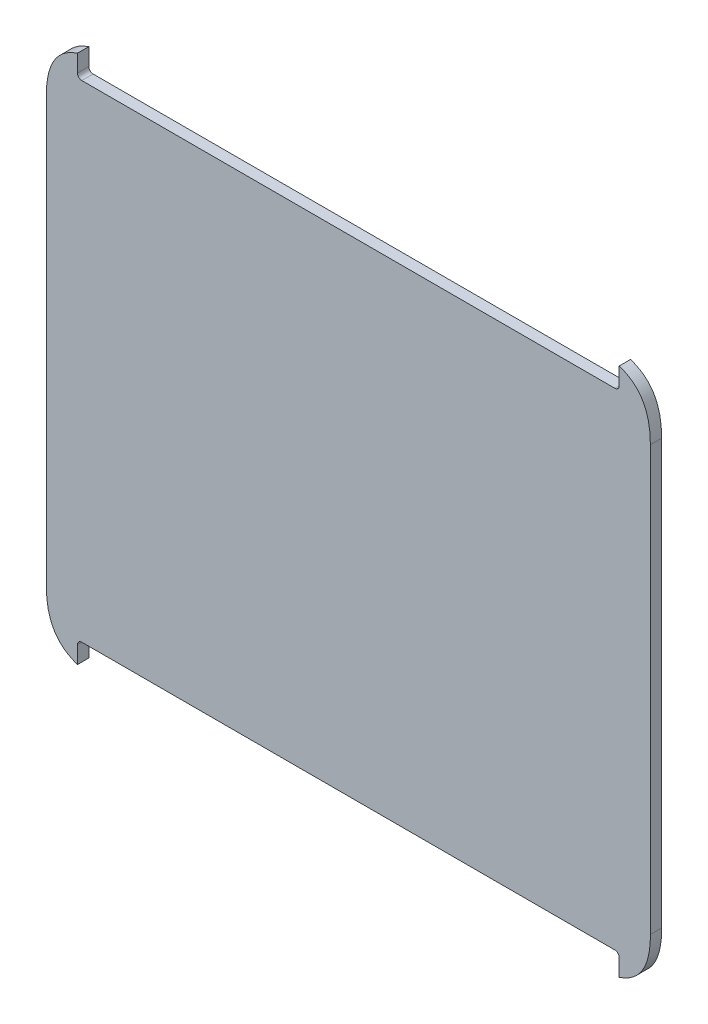
ISO-10303-21;
HEADER;
FILE_DESCRIPTION(('STEP AP214'),'2;1');
FILE_NAME('part.step','',(''),(''),'','','');
FILE_SCHEMA(('AUTOMOTIVE_DESIGN { 1 0 10303 214 1 1 1 1 }'));
ENDSEC;
DATA;
#1=APPLICATION_CONTEXT('core data for automotive mechanical design processes');
#2=APPLICATION_PROTOCOL_DEFINITION('international standard','automotive_design',2000,#1);
#3=PRODUCT_CONTEXT('',#1,'mechanical');
#4=PRODUCT('Part','Part','',(#3));
#5=PRODUCT_RELATED_PRODUCT_CATEGORY('part','',(#4));
#6=PRODUCT_DEFINITION_FORMATION('','',#4);
#7=PRODUCT_DEFINITION_CONTEXT('part definition',#1,'design');
#8=PRODUCT_DEFINITION('design','',#6,#7);
#9=PRODUCT_DEFINITION_SHAPE('','',#8);
#10=(LENGTH_UNIT() NAMED_UNIT(*) SI_UNIT(.MILLI.,.METRE.));
#11=(NAMED_UNIT(*) PLANE_ANGLE_UNIT() SI_UNIT($,.RADIAN.));
#12=(NAMED_UNIT(*) SI_UNIT($,.STERADIAN.) SOLID_ANGLE_UNIT());
#13=UNCERTAINTY_MEASURE_WITH_UNIT(LENGTH_MEASURE(1.E-05),#10,'distance_accuracy_value','');
#14=(GEOMETRIC_REPRESENTATION_CONTEXT(3) GLOBAL_UNCERTAINTY_ASSIGNED_CONTEXT((#13)) GLOBAL_UNIT_ASSIGNED_CONTEXT((#10,
#11,#12)) REPRESENTATION_CONTEXT('',''));
#15=CARTESIAN_POINT('',(0.,0.,0.));
#16=DIRECTION('',(0.,0.,1.));
#17=DIRECTION('',(1.,0.,0.));
#18=AXIS2_PLACEMENT_3D('',#15,#16,#17);
#19=CARTESIAN_POINT('',(-53.2255642787466,-60.0188450650268,0.));
#20=DIRECTION('',(0.,0.,-1.));
#21=DIRECTION('',(-1.,0.,0.));
#22=AXIS2_PLACEMENT_3D('',#19,#20,#21);
#23=PLANE('',#22);
#24=CARTESIAN_POINT('',(-25.4,-36.9113714706194,0.));
#25=CARTESIAN_POINT('',(-52.8948927968745,-46.0339327460472,0.));
#26=CARTESIAN_POINT('',(-60.4299589598373,-69.6743913695335,0.));
#27=CARTESIAN_POINT('',(-60.4299589598373,-96.1144167028532,0.));
#28=B_SPLINE_CURVE_WITH_KNOTS('',3,(#24,#25,#26,#27),.UNSPECIFIED.,.F.,.F.,(4,4),(0.,1.),.UNSPECIFIED.);
#29=CARTESIAN_POINT('',(-25.4,-36.9113714706194,0.));
#30=VERTEX_POINT('',#29);
#31=CARTESIAN_POINT('',(-60.4299589598373,-96.1144167028532,0.));
#32=VERTEX_POINT('',#31);
#33=EDGE_CURVE('E160',#30,#32,#28,.T.);
#34=ORIENTED_EDGE('',*,*,#33,.F.);
#35=DIRECTION('',(0.,1.,0.));
#36=VECTOR('',#35,1.);
#37=CARTESIAN_POINT('',(-25.3999999999999,-56.2584577430158,0.));
#38=LINE('',#37,#36);
#39=CARTESIAN_POINT('',(-25.3999999999999,-56.2584577430158,0.));
#40=VERTEX_POINT('',#39);
#41=EDGE_CURVE('E232',#40,#30,#38,.T.);
#42=ORIENTED_EDGE('',*,*,#41,.F.);
#43=CARTESIAN_POINT('',(-20.5739999999999,-56.2584577430158,0.));
#44=DIRECTION('',(0.,0.,-1.));
#45=DIRECTION('',(-1.,0.,0.));
#46=AXIS2_PLACEMENT_3D('',#43,#44,#45);
#47=CIRCLE('',#46,4.826);
#48=CARTESIAN_POINT('',(-20.5739999999999,-61.0844577430158,0.));
#49=VERTEX_POINT('',#48);
#50=EDGE_CURVE('E229',#49,#40,#47,.T.);
#51=ORIENTED_EDGE('',*,*,#50,.F.);
#52=DIRECTION('',(-1.,0.,0.));
#53=VECTOR('',#52,1.);
#54=CARTESIAN_POINT('',(-20.5739999999999,-61.0844577430158,0.));
#55=LINE('',#54,#53);
#56=CARTESIAN_POINT('',(578.569437197718,-61.0844577430158,0.));
#57=VERTEX_POINT('',#56);
#58=EDGE_CURVE('E226',#57,#49,#55,.T.);
#59=ORIENTED_EDGE('',*,*,#58,.F.);
#60=CARTESIAN_POINT('',(578.569437197718,-56.2584577430158,0.));
#61=DIRECTION('',(0.,0.,-1.));
#62=DIRECTION('',(1.,0.,0.));
#63=AXIS2_PLACEMENT_3D('',#60,#61,#62);
#64=CIRCLE('',#63,4.826);
#65=CARTESIAN_POINT('',(583.395437197718,-56.2584577430158,0.));
#66=VERTEX_POINT('',#65);
#67=EDGE_CURVE('E223',#66,#57,#64,.T.);
#68=ORIENTED_EDGE('',*,*,#67,.F.);
#69=DIRECTION('',(0.,-1.,0.));
#70=VECTOR('',#69,1.);
#71=CARTESIAN_POINT('',(583.395437197718,-56.2584577430158,0.));
#72=LINE('',#71,#70);
#73=CARTESIAN_POINT('',(583.395437197718,-36.9113714706194,0.));
#74=VERTEX_POINT('',#73);
#75=EDGE_CURVE('E217',#74,#66,#72,.T.);
#76=ORIENTED_EDGE('',*,*,#75,.F.);
#77=CARTESIAN_POINT('',(618.425396157556,-96.1144167028532,0.));
#78=CARTESIAN_POINT('',(618.425396157556,-69.6743913695335,0.));
#79=CARTESIAN_POINT('',(610.890329994593,-46.0339327460472,0.));
#80=CARTESIAN_POINT('',(583.395437197718,-36.9113714706194,0.));
#81=B_SPLINE_CURVE_WITH_KNOTS('',3,(#77,#78,#79,#80),.UNSPECIFIED.,.F.,.F.,(4,4),(0.,1.),.UNSPECIFIED.);
#82=CARTESIAN_POINT('',(618.425396157556,-96.1144167028532,0.));
#83=VERTEX_POINT('',#82);
#84=EDGE_CURVE('E212',#83,#74,#81,.T.);
#85=ORIENTED_EDGE('',*,*,#84,.F.);
#86=DIRECTION('',(0.,1.,0.));
#87=VECTOR('',#86,1.);
#88=CARTESIAN_POINT('',(618.425396157556,-96.1144167028532,0.));
#89=LINE('',#88,#87);
#90=CARTESIAN_POINT('',(618.425396157556,-572.727698857594,0.));
#91=VERTEX_POINT('',#90);
#92=EDGE_CURVE('E206',#91,#83,#89,.T.);
#93=ORIENTED_EDGE('',*,*,#92,.F.);
#94=CARTESIAN_POINT('',(583.395437197718,-631.930744089828,0.));
#95=CARTESIAN_POINT('',(610.890329994593,-622.8081828144,0.));
#96=CARTESIAN_POINT('',(618.425396157556,-599.167724190914,0.));
#97=CARTESIAN_POINT('',(618.425396157556,-572.727698857594,0.));
#98=B_SPLINE_CURVE_WITH_KNOTS('',3,(#94,#95,#96,#97),.UNSPECIFIED.,.F.,.F.,(4,4),(0.,1.),.UNSPECIFIED.);
#99=CARTESIAN_POINT('',(583.395437197718,-631.930744089828,0.));
#100=VERTEX_POINT('',#99);
#101=EDGE_CURVE('E201',#100,#91,#98,.T.);
#102=ORIENTED_EDGE('',*,*,#101,.F.);
#103=DIRECTION('',(0.,-1.,0.));
#104=VECTOR('',#103,1.);
#105=CARTESIAN_POINT('',(583.395437197718,-612.583657817431,0.));
#106=LINE('',#105,#104);
#107=CARTESIAN_POINT('',(583.395437197718,-612.583657817431,0.));
#108=VERTEX_POINT('',#107);
#109=EDGE_CURVE('E198',#108,#100,#106,.T.);
#110=ORIENTED_EDGE('',*,*,#109,.F.);
#111=CARTESIAN_POINT('',(578.569437197718,-612.583657817431,0.));
#112=DIRECTION('',(0.,0.,-1.));
#113=DIRECTION('',(1.,0.,0.));
#114=AXIS2_PLACEMENT_3D('',#111,#112,#113);
#115=CIRCLE('',#114,4.826);
#116=CARTESIAN_POINT('',(578.569437197718,-607.757657817431,0.));
#117=VERTEX_POINT('',#116);
#118=EDGE_CURVE('E195',#117,#108,#115,.T.);
#119=ORIENTED_EDGE('',*,*,#118,.F.);
#120=DIRECTION('',(1.,0.,0.));
#121=VECTOR('',#120,1.);
#122=CARTESIAN_POINT('',(-20.5739999999999,-607.757657817431,0.));
#123=LINE('',#122,#121);
#124=CARTESIAN_POINT('',(-20.5739999999999,-607.757657817431,0.));
#125=VERTEX_POINT('',#124);
#126=EDGE_CURVE('E192',#125,#117,#123,.T.);
#127=ORIENTED_EDGE('',*,*,#126,.F.);
#128=CARTESIAN_POINT('',(-20.5739999999999,-612.583657817431,0.));
#129=DIRECTION('',(0.,0.,-1.));
#130=DIRECTION('',(-1.,0.,0.));
#131=AXIS2_PLACEMENT_3D('',#128,#129,#130);
#132=CIRCLE('',#131,4.826);
#133=CARTESIAN_POINT('',(-25.3999999999999,-612.583657817431,0.));
#134=VERTEX_POINT('',#133);
#135=EDGE_CURVE('E189',#134,#125,#132,.T.);
#136=ORIENTED_EDGE('',*,*,#135,.F.);
#137=DIRECTION('',(0.,1.,0.));
#138=VECTOR('',#137,1.);
#139=CARTESIAN_POINT('',(-25.3999999999999,-612.583657817431,0.));
#140=LINE('',#139,#138);
#141=CARTESIAN_POINT('',(-25.4,-631.930744089828,0.));
#142=VERTEX_POINT('',#141);
#143=EDGE_CURVE('E183',#142,#134,#140,.T.);
#144=ORIENTED_EDGE('',*,*,#143,.F.);
#145=CARTESIAN_POINT('',(-60.4299589598373,-572.727698857594,0.));
#146=CARTESIAN_POINT('',(-60.4299589598373,-599.167724190914,0.));
#147=CARTESIAN_POINT('',(-52.8948927968745,-622.8081828144,0.));
#148=CARTESIAN_POINT('',(-25.4,-631.930744089828,0.));
#149=B_SPLINE_CURVE_WITH_KNOTS('',3,(#145,#146,#147,#148),.UNSPECIFIED.,.F.,.F.,(4,4),(0.,1.),.UNSPECIFIED.);
#150=CARTESIAN_POINT('',(-60.4299589598373,-572.727698857594,0.));
#151=VERTEX_POINT('',#150);
#152=EDGE_CURVE('E163',#151,#142,#149,.T.);
#153=ORIENTED_EDGE('',*,*,#152,.F.);
#154=DIRECTION('',(0.,-1.,0.));
#155=VECTOR('',#154,1.);
#156=CARTESIAN_POINT('',(-60.4299589598373,-96.1144167028532,0.));
#157=LINE('',#156,#155);
#158=EDGE_CURVE('E152',#32,#151,#157,.T.);
#159=ORIENTED_EDGE('',*,*,#158,.F.);
#160=EDGE_LOOP('',(#34,#42,#51,#59,#68,#76,#85,#93,#102,#110,#119,#127,#136,#144,#153,#159));
#161=FACE_BOUND('',#160,.T.);
#162=ADVANCED_FACE('F35',(#161),#23,.T.);
#163=CARTESIAN_POINT('',(-25.3999999999999,-56.2584577430158,915.414044957604));
#164=DIRECTION('',(-1.,0.,0.));
#165=DIRECTION('',(0.,-1.,0.));
#166=AXIS2_PLACEMENT_3D('',#163,#164,#165);
#167=PLANE('',#166);
#168=DIRECTION('',(0.,0.,-1.));
#169=VECTOR('',#168,1.);
#170=CARTESIAN_POINT('',(-25.4,-36.9113714706194,915.414044957604));
#171=LINE('',#170,#169);
#172=CARTESIAN_POINT('',(-25.4,-36.9113714706194,12.7000000000001));
#173=VERTEX_POINT('',#172);
#174=EDGE_CURVE('E166',#173,#30,#171,.T.);
#175=ORIENTED_EDGE('',*,*,#174,.F.);
#176=DIRECTION('',(0.,-1.,0.));
#177=VECTOR('',#176,1.);
#178=CARTESIAN_POINT('',(-25.3999999999999,-56.2584577430164,12.7000000000002));
#179=LINE('',#178,#177);
#180=CARTESIAN_POINT('',(-25.3999999999999,-56.2584577430158,12.7000000000002));
#181=VERTEX_POINT('',#180);
#182=EDGE_CURVE('E40',#173,#181,#179,.T.);
#183=ORIENTED_EDGE('',*,*,#182,.T.);
#184=DIRECTION('',(0.,0.,-1.));
#185=VECTOR('',#184,1.);
#186=CARTESIAN_POINT('',(-25.3999999999999,-56.2584577430158,915.414044957604));
#187=LINE('',#186,#185);
#188=EDGE_CURVE('E235',#181,#40,#187,.T.);
#189=ORIENTED_EDGE('',*,*,#188,.T.);
#190=ORIENTED_EDGE('',*,*,#41,.T.);
#191=EDGE_LOOP('',(#175,#183,#189,#190));
#192=FACE_BOUND('',#191,.T.);
#193=ADVANCED_FACE('F307',(#192),#167,.F.);
#194=CARTESIAN_POINT('',(-20.5739999999999,-56.2584577430158,915.414044957604));
#195=DIRECTION('',(0.,0.,-1.));
#196=DIRECTION('',(-1.,0.,0.));
#197=AXIS2_PLACEMENT_3D('',#194,#195,#196);
#198=CYLINDRICAL_SURFACE('',#197,4.826);
#199=ORIENTED_EDGE('',*,*,#188,.F.);
#200=CARTESIAN_POINT('',(-20.5739999999999,-56.2584577430158,12.7000000000002));
#201=DIRECTION('',(0.,0.,-1.));
#202=DIRECTION('',(0.,1.,0.));
#203=AXIS2_PLACEMENT_3D('',#200,#201,#202);
#204=CIRCLE('',#203,4.826);
#205=CARTESIAN_POINT('',(-20.5739999999999,-61.0844577430158,12.7000000000002));
#206=VERTEX_POINT('',#205);
#207=EDGE_CURVE('E405',#181,#206,#204,.F.);
#208=ORIENTED_EDGE('',*,*,#207,.T.);
#209=DIRECTION('',(0.,0.,-1.));
#210=VECTOR('',#209,1.);
#211=CARTESIAN_POINT('',(-20.5739999999999,-61.0844577430158,915.414044957604));
#212=LINE('',#211,#210);
#213=EDGE_CURVE('E237',#206,#49,#212,.T.);
#214=ORIENTED_EDGE('',*,*,#213,.T.);
#215=ORIENTED_EDGE('',*,*,#50,.T.);
#216=EDGE_LOOP('',(#199,#208,#214,#215));
#217=FACE_BOUND('',#216,.T.);
#218=ADVANCED_FACE('F312',(#217),#198,.F.);
#219=CARTESIAN_POINT('',(-20.5739999999999,-61.0844577430158,915.414044957604));
#220=DIRECTION('',(0.,-1.,0.));
#221=DIRECTION('',(0.,0.,-1.));
#222=AXIS2_PLACEMENT_3D('',#219,#220,#221);
#223=PLANE('',#222);
#224=ORIENTED_EDGE('',*,*,#213,.F.);
#225=DIRECTION('',(1.,0.,0.));
#226=VECTOR('',#225,1.);
#227=CARTESIAN_POINT('',(-20.5739999999999,-61.0844577430158,12.7000000000002));
#228=LINE('',#227,#226);
#229=CARTESIAN_POINT('',(578.569437197718,-61.0844577430158,12.7000000000002));
#230=VERTEX_POINT('',#229);
#231=EDGE_CURVE('E402',#206,#230,#228,.T.);
#232=ORIENTED_EDGE('',*,*,#231,.T.);
#233=DIRECTION('',(0.,0.,-1.));
#234=VECTOR('',#233,1.);
#235=CARTESIAN_POINT('',(578.569437197718,-61.0844577430158,915.414044957604));
#236=LINE('',#235,#234);
#237=EDGE_CURVE('E239',#230,#57,#236,.T.);
#238=ORIENTED_EDGE('',*,*,#237,.T.);
#239=ORIENTED_EDGE('',*,*,#58,.T.);
#240=EDGE_LOOP('',(#224,#232,#238,#239));
#241=FACE_BOUND('',#240,.T.);
#242=ADVANCED_FACE('F319',(#241),#223,.F.);
#243=CARTESIAN_POINT('',(578.569437197718,-56.2584577430158,915.414044957604));
#244=DIRECTION('',(0.,0.,-1.));
#245=DIRECTION('',(-1.,0.,0.));
#246=AXIS2_PLACEMENT_3D('',#243,#244,#245);
#247=CYLINDRICAL_SURFACE('',#246,4.826);
#248=ORIENTED_EDGE('',*,*,#237,.F.);
#249=CARTESIAN_POINT('',(578.569437197718,-56.2584577430158,12.7000000000002));
#250=DIRECTION('',(0.,0.,-1.));
#251=DIRECTION('',(0.,1.,0.));
#252=AXIS2_PLACEMENT_3D('',#249,#250,#251);
#253=CIRCLE('',#252,4.826);
#254=CARTESIAN_POINT('',(583.395437197718,-56.2584577430158,12.7000000000002));
#255=VERTEX_POINT('',#254);
#256=EDGE_CURVE('E399',#230,#255,#253,.F.);
#257=ORIENTED_EDGE('',*,*,#256,.T.);
#258=DIRECTION('',(0.,0.,-1.));
#259=VECTOR('',#258,1.);
#260=CARTESIAN_POINT('',(583.395437197718,-56.2584577430158,915.414044957604));
#261=LINE('',#260,#259);
#262=EDGE_CURVE('E241',#255,#66,#261,.T.);
#263=ORIENTED_EDGE('',*,*,#262,.T.);
#264=ORIENTED_EDGE('',*,*,#67,.T.);
#265=EDGE_LOOP('',(#248,#257,#263,#264));
#266=FACE_BOUND('',#265,.T.);
#267=ADVANCED_FACE('F323',(#266),#247,.F.);
#268=CARTESIAN_POINT('',(583.395437197718,-56.2584577430158,915.414044957604));
#269=DIRECTION('',(1.,0.,0.));
#270=DIRECTION('',(0.,1.,0.));
#271=AXIS2_PLACEMENT_3D('',#268,#269,#270);
#272=PLANE('',#271);
#273=ORIENTED_EDGE('',*,*,#262,.F.);
#274=DIRECTION('',(0.,1.,0.));
#275=VECTOR('',#274,1.);
#276=CARTESIAN_POINT('',(583.395437197718,-56.2584577430164,12.7000000000002));
#277=LINE('',#276,#275);
#278=CARTESIAN_POINT('',(583.395437197718,-36.9113714706194,12.7000000000001));
#279=VERTEX_POINT('',#278);
#280=EDGE_CURVE('E393',#255,#279,#277,.T.);
#281=ORIENTED_EDGE('',*,*,#280,.T.);
#282=DIRECTION('',(0.,0.,-1.));
#283=VECTOR('',#282,1.);
#284=CARTESIAN_POINT('',(583.395437197718,-36.9113714706194,915.414044957604));
#285=LINE('',#284,#283);
#286=EDGE_CURVE('E243',#279,#74,#285,.T.);
#287=ORIENTED_EDGE('',*,*,#286,.T.);
#288=ORIENTED_EDGE('',*,*,#75,.T.);
#289=EDGE_LOOP('',(#273,#281,#287,#288));
#290=FACE_BOUND('',#289,.T.);
#291=ADVANCED_FACE('F327',(#290),#272,.F.);
#292=CARTESIAN_POINT('',(618.425396157556,-96.1144167028532,915.414044957604));
#293=CARTESIAN_POINT('',(618.425396157556,-69.6743913695335,915.414044957604));
#294=CARTESIAN_POINT('',(610.890329994593,-46.0339327460472,915.414044957604));
#295=CARTESIAN_POINT('',(583.395437197718,-36.9113714706194,915.414044957604));
#296=B_SPLINE_CURVE_WITH_KNOTS('',3,(#292,#293,#294,#295),.UNSPECIFIED.,.F.,.F.,(4,4),(0.,1.),.UNSPECIFIED.);
#297=DIRECTION('',(0.,0.,-1.));
#298=VECTOR('',#297,1.);
#299=SURFACE_OF_LINEAR_EXTRUSION('',#296,#298);
#300=ORIENTED_EDGE('',*,*,#286,.F.);
#301=CARTESIAN_POINT('',(618.425396157556,-96.1144167028532,12.7000000000005));
#302=CARTESIAN_POINT('',(618.425396157556,-69.6743913695335,12.7000000000005));
#303=CARTESIAN_POINT('',(610.890329994593,-46.0339327460472,12.7000000000005));
#304=CARTESIAN_POINT('',(583.395437197718,-36.9113714706194,12.7000000000005));
#305=B_SPLINE_CURVE_WITH_KNOTS('',3,(#301,#302,#303,#304),.UNSPECIFIED.,.F.,.F.,(4,4),(0.,1.),.UNSPECIFIED.);
#306=CARTESIAN_POINT('',(618.425396157556,-96.1144167028532,12.7000000000005));
#307=VERTEX_POINT('',#306);
#308=EDGE_CURVE('E388',#279,#307,#305,.F.);
#309=ORIENTED_EDGE('',*,*,#308,.T.);
#310=DIRECTION('',(0.,0.,-1.));
#311=VECTOR('',#310,1.);
#312=CARTESIAN_POINT('',(618.425396157556,-96.1144167028532,915.414044957604));
#313=LINE('',#312,#311);
#314=EDGE_CURVE('E245',#307,#83,#313,.T.);
#315=ORIENTED_EDGE('',*,*,#314,.T.);
#316=ORIENTED_EDGE('',*,*,#84,.T.);
#317=EDGE_LOOP('',(#300,#309,#315,#316));
#318=FACE_BOUND('',#317,.T.);
#319=ADVANCED_FACE('F331',(#318),#299,.F.);
#320=CARTESIAN_POINT('',(618.425396157556,-96.1144167028532,915.414044957604));
#321=DIRECTION('',(-1.,0.,0.));
#322=DIRECTION('',(0.,0.,1.));
#323=AXIS2_PLACEMENT_3D('',#320,#321,#322);
#324=PLANE('',#323);
#325=ORIENTED_EDGE('',*,*,#314,.F.);
#326=DIRECTION('',(0.,-1.,0.));
#327=VECTOR('',#326,1.);
#328=CARTESIAN_POINT('',(618.425396157556,-96.1144167028538,12.7000000000002));
#329=LINE('',#328,#327);
#330=CARTESIAN_POINT('',(618.425396157556,-572.727698857594,12.7000000000005));
#331=VERTEX_POINT('',#330);
#332=EDGE_CURVE('E382',#307,#331,#329,.T.);
#333=ORIENTED_EDGE('',*,*,#332,.T.);
#334=DIRECTION('',(0.,0.,-1.));
#335=VECTOR('',#334,1.);
#336=CARTESIAN_POINT('',(618.425396157556,-572.727698857594,915.414044957604));
#337=LINE('',#336,#335);
#338=EDGE_CURVE('E247',#331,#91,#337,.T.);
#339=ORIENTED_EDGE('',*,*,#338,.T.);
#340=ORIENTED_EDGE('',*,*,#92,.T.);
#341=EDGE_LOOP('',(#325,#333,#339,#340));
#342=FACE_BOUND('',#341,.T.);
#343=ADVANCED_FACE('F335',(#342),#324,.F.);
#344=CARTESIAN_POINT('',(583.395437197718,-631.930744089828,915.414044957604));
#345=CARTESIAN_POINT('',(610.890329994593,-622.8081828144,915.414044957604));
#346=CARTESIAN_POINT('',(618.425396157556,-599.167724190914,915.414044957604));
#347=CARTESIAN_POINT('',(618.425396157556,-572.727698857594,915.414044957604));
#348=B_SPLINE_CURVE_WITH_KNOTS('',3,(#344,#345,#346,#347),.UNSPECIFIED.,.F.,.F.,(4,4),(0.,1.),.UNSPECIFIED.);
#349=DIRECTION('',(0.,0.,-1.));
#350=VECTOR('',#349,1.);
#351=SURFACE_OF_LINEAR_EXTRUSION('',#348,#350);
#352=ORIENTED_EDGE('',*,*,#338,.F.);
#353=CARTESIAN_POINT('',(583.395437197718,-631.930744089828,12.7000000000005));
#354=CARTESIAN_POINT('',(610.890329994593,-622.8081828144,12.7000000000005));
#355=CARTESIAN_POINT('',(618.425396157556,-599.167724190914,12.7000000000005));
#356=CARTESIAN_POINT('',(618.425396157556,-572.727698857594,12.7000000000005));
#357=B_SPLINE_CURVE_WITH_KNOTS('',3,(#353,#354,#355,#356),.UNSPECIFIED.,.F.,.F.,(4,4),(0.,1.),.UNSPECIFIED.);
#358=CARTESIAN_POINT('',(583.395437197718,-631.930744089828,12.7000000000005));
#359=VERTEX_POINT('',#358);
#360=EDGE_CURVE('E377',#331,#359,#357,.F.);
#361=ORIENTED_EDGE('',*,*,#360,.T.);
#362=DIRECTION('',(0.,0.,-1.));
#363=VECTOR('',#362,1.);
#364=CARTESIAN_POINT('',(583.395437197718,-631.930744089828,915.414044957604));
#365=LINE('',#364,#363);
#366=EDGE_CURVE('E249',#359,#100,#365,.T.);
#367=ORIENTED_EDGE('',*,*,#366,.T.);
#368=ORIENTED_EDGE('',*,*,#101,.T.);
#369=EDGE_LOOP('',(#352,#361,#367,#368));
#370=FACE_BOUND('',#369,.T.);
#371=ADVANCED_FACE('F339',(#370),#351,.F.);
#372=CARTESIAN_POINT('',(583.395437197718,-612.583657817431,915.414044957604));
#373=DIRECTION('',(1.,0.,0.));
#374=DIRECTION('',(0.,1.,0.));
#375=AXIS2_PLACEMENT_3D('',#372,#373,#374);
#376=PLANE('',#375);
#377=ORIENTED_EDGE('',*,*,#366,.F.);
#378=DIRECTION('',(0.,1.,0.));
#379=VECTOR('',#378,1.);
#380=CARTESIAN_POINT('',(583.395437197718,-612.583657817432,12.7000000000005));
#381=LINE('',#380,#379);
#382=CARTESIAN_POINT('',(583.395437197718,-612.583657817431,12.7000000000005));
#383=VERTEX_POINT('',#382);
#384=EDGE_CURVE('E372',#359,#383,#381,.T.);
#385=ORIENTED_EDGE('',*,*,#384,.T.);
#386=DIRECTION('',(0.,0.,-1.));
#387=VECTOR('',#386,1.);
#388=CARTESIAN_POINT('',(583.395437197718,-612.583657817431,915.414044957604));
#389=LINE('',#388,#387);
#390=EDGE_CURVE('E251',#383,#108,#389,.T.);
#391=ORIENTED_EDGE('',*,*,#390,.T.);
#392=ORIENTED_EDGE('',*,*,#109,.T.);
#393=EDGE_LOOP('',(#377,#385,#391,#392));
#394=FACE_BOUND('',#393,.T.);
#395=ADVANCED_FACE('F343',(#394),#376,.F.);
#396=CARTESIAN_POINT('',(578.569437197718,-612.583657817431,915.414044957604));
#397=DIRECTION('',(0.,0.,-1.));
#398=DIRECTION('',(-1.,0.,0.));
#399=AXIS2_PLACEMENT_3D('',#396,#397,#398);
#400=CYLINDRICAL_SURFACE('',#399,4.826);
#401=ORIENTED_EDGE('',*,*,#390,.F.);
#402=CARTESIAN_POINT('',(578.569437197718,-612.583657817431,12.7000000000005));
#403=DIRECTION('',(0.,0.,-1.));
#404=DIRECTION('',(0.,1.,0.));
#405=AXIS2_PLACEMENT_3D('',#402,#403,#404);
#406=CIRCLE('',#405,4.826);
#407=CARTESIAN_POINT('',(578.569437197718,-607.757657817431,12.7000000000005));
#408=VERTEX_POINT('',#407);
#409=EDGE_CURVE('E370',#383,#408,#406,.F.);
#410=ORIENTED_EDGE('',*,*,#409,.T.);
#411=DIRECTION('',(0.,0.,-1.));
#412=VECTOR('',#411,1.);
#413=CARTESIAN_POINT('',(578.569437197718,-607.757657817431,915.414044957604));
#414=LINE('',#413,#412);
#415=EDGE_CURVE('E253',#408,#117,#414,.T.);
#416=ORIENTED_EDGE('',*,*,#415,.T.);
#417=ORIENTED_EDGE('',*,*,#118,.T.);
#418=EDGE_LOOP('',(#401,#410,#416,#417));
#419=FACE_BOUND('',#418,.T.);
#420=ADVANCED_FACE('F347',(#419),#400,.F.);
#421=CARTESIAN_POINT('',(-20.5739999999999,-607.757657817431,915.414044957604));
#422=DIRECTION('',(0.,1.,0.));
#423=DIRECTION('',(0.,0.,1.));
#424=AXIS2_PLACEMENT_3D('',#421,#422,#423);
#425=PLANE('',#424);
#426=ORIENTED_EDGE('',*,*,#415,.F.);
#427=DIRECTION('',(-1.,0.,0.));
#428=VECTOR('',#427,1.);
#429=CARTESIAN_POINT('',(-20.5739999999999,-607.757657817431,12.7000000000005));
#430=LINE('',#429,#428);
#431=CARTESIAN_POINT('',(-20.5739999999999,-607.757657817431,12.7000000000005));
#432=VERTEX_POINT('',#431);
#433=EDGE_CURVE('E368',#408,#432,#430,.T.);
#434=ORIENTED_EDGE('',*,*,#433,.T.);
#435=DIRECTION('',(0.,0.,-1.));
#436=VECTOR('',#435,1.);
#437=CARTESIAN_POINT('',(-20.5739999999999,-607.757657817431,915.414044957604));
#438=LINE('',#437,#436);
#439=EDGE_CURVE('E255',#432,#125,#438,.T.);
#440=ORIENTED_EDGE('',*,*,#439,.T.);
#441=ORIENTED_EDGE('',*,*,#126,.T.);
#442=EDGE_LOOP('',(#426,#434,#440,#441));
#443=FACE_BOUND('',#442,.T.);
#444=ADVANCED_FACE('F351',(#443),#425,.F.);
#445=CARTESIAN_POINT('',(-20.5739999999999,-612.583657817431,915.414044957604));
#446=DIRECTION('',(0.,0.,-1.));
#447=DIRECTION('',(-1.,0.,0.));
#448=AXIS2_PLACEMENT_3D('',#445,#446,#447);
#449=CYLINDRICAL_SURFACE('',#448,4.826);
#450=ORIENTED_EDGE('',*,*,#439,.F.);
#451=CARTESIAN_POINT('',(-20.5739999999999,-612.583657817431,12.7000000000005));
#452=DIRECTION('',(0.,0.,-1.));
#453=DIRECTION('',(0.,1.,0.));
#454=AXIS2_PLACEMENT_3D('',#451,#452,#453);
#455=CIRCLE('',#454,4.826);
#456=CARTESIAN_POINT('',(-25.3999999999999,-612.583657817431,12.7000000000005));
#457=VERTEX_POINT('',#456);
#458=EDGE_CURVE('E267',#432,#457,#455,.F.);
#459=ORIENTED_EDGE('',*,*,#458,.T.);
#460=DIRECTION('',(0.,0.,-1.));
#461=VECTOR('',#460,1.);
#462=CARTESIAN_POINT('',(-25.3999999999999,-612.583657817431,915.414044957604));
#463=LINE('',#462,#461);
#464=EDGE_CURVE('E257',#457,#134,#463,.T.);
#465=ORIENTED_EDGE('',*,*,#464,.T.);
#466=ORIENTED_EDGE('',*,*,#135,.T.);
#467=EDGE_LOOP('',(#450,#459,#465,#466));
#468=FACE_BOUND('',#467,.T.);
#469=ADVANCED_FACE('F354',(#468),#449,.F.);
#470=CARTESIAN_POINT('',(-25.3999999999999,-612.583657817431,915.414044957604));
#471=DIRECTION('',(-1.,0.,0.));
#472=DIRECTION('',(0.,-1.,0.));
#473=AXIS2_PLACEMENT_3D('',#470,#471,#472);
#474=PLANE('',#473);
#475=ORIENTED_EDGE('',*,*,#464,.F.);
#476=DIRECTION('',(0.,-1.,0.));
#477=VECTOR('',#476,1.);
#478=CARTESIAN_POINT('',(-25.3999999999999,-612.583657817432,12.7000000000005));
#479=LINE('',#478,#477);
#480=CARTESIAN_POINT('',(-25.4,-631.930744089828,12.7000000000005));
#481=VERTEX_POINT('',#480);
#482=EDGE_CURVE('E264',#457,#481,#479,.T.);
#483=ORIENTED_EDGE('',*,*,#482,.T.);
#484=DIRECTION('',(0.,0.,-1.));
#485=VECTOR('',#484,1.);
#486=CARTESIAN_POINT('',(-25.4,-631.930744089828,915.414044957604));
#487=LINE('',#486,#485);
#488=EDGE_CURVE('E259',#481,#142,#487,.T.);
#489=ORIENTED_EDGE('',*,*,#488,.T.);
#490=ORIENTED_EDGE('',*,*,#143,.T.);
#491=EDGE_LOOP('',(#475,#483,#489,#490));
#492=FACE_BOUND('',#491,.T.);
#493=ADVANCED_FACE('F299',(#492),#474,.F.);
#494=CARTESIAN_POINT('',(-60.4299589598373,-572.727698857594,915.414044957604));
#495=CARTESIAN_POINT('',(-60.4299589598373,-599.167724190914,915.414044957604));
#496=CARTESIAN_POINT('',(-52.8948927968745,-622.8081828144,915.414044957604));
#497=CARTESIAN_POINT('',(-25.4,-631.930744089828,915.414044957604));
#498=B_SPLINE_CURVE_WITH_KNOTS('',3,(#494,#495,#496,#497),.UNSPECIFIED.,.F.,.F.,(4,4),(0.,1.),.UNSPECIFIED.);
#499=DIRECTION('',(0.,0.,-1.));
#500=VECTOR('',#499,1.);
#501=SURFACE_OF_LINEAR_EXTRUSION('',#498,#500);
#502=ORIENTED_EDGE('',*,*,#488,.F.);
#503=CARTESIAN_POINT('',(-60.4299589598373,-572.727698857594,12.7000000000005));
#504=CARTESIAN_POINT('',(-60.4299589598373,-599.167724190914,12.7000000000005));
#505=CARTESIAN_POINT('',(-52.8948927968745,-622.8081828144,12.7000000000005));
#506=CARTESIAN_POINT('',(-25.4,-631.930744089828,12.7000000000005));
#507=B_SPLINE_CURVE_WITH_KNOTS('',3,(#503,#504,#505,#506),.UNSPECIFIED.,.F.,.F.,(4,4),(0.,1.),.UNSPECIFIED.);
#508=CARTESIAN_POINT('',(-60.4299589598373,-572.727698857594,12.7000000000005));
#509=VERTEX_POINT('',#508);
#510=EDGE_CURVE('E57',#481,#509,#507,.F.);
#511=ORIENTED_EDGE('',*,*,#510,.T.);
#512=DIRECTION('',(0.,0.,-1.));
#513=VECTOR('',#512,1.);
#514=CARTESIAN_POINT('',(-60.4299589598373,-572.727698857594,915.414044957604));
#515=LINE('',#514,#513);
#516=EDGE_CURVE('E156',#509,#151,#515,.T.);
#517=ORIENTED_EDGE('',*,*,#516,.T.);
#518=ORIENTED_EDGE('',*,*,#152,.T.);
#519=EDGE_LOOP('',(#502,#511,#517,#518));
#520=FACE_BOUND('',#519,.T.);
#521=ADVANCED_FACE('F262',(#520),#501,.F.);
#522=CARTESIAN_POINT('',(-60.4299589598373,-96.1144167028532,915.414044957604));
#523=DIRECTION('',(1.,0.,0.));
#524=DIRECTION('',(0.,0.,-1.));
#525=AXIS2_PLACEMENT_3D('',#522,#523,#524);
#526=PLANE('',#525);
#527=ORIENTED_EDGE('',*,*,#516,.F.);
#528=DIRECTION('',(0.,1.,0.));
#529=VECTOR('',#528,1.);
#530=CARTESIAN_POINT('',(-60.4299589598373,-96.1144167028538,12.7000000000002));
#531=LINE('',#530,#529);
#532=CARTESIAN_POINT('',(-60.4299589598373,-96.1144167028532,12.7000000000002));
#533=VERTEX_POINT('',#532);
#534=EDGE_CURVE('E45',#509,#533,#531,.T.);
#535=ORIENTED_EDGE('',*,*,#534,.T.);
#536=DIRECTION('',(0.,0.,-1.));
#537=VECTOR('',#536,1.);
#538=CARTESIAN_POINT('',(-60.4299589598373,-96.1144167028532,915.414044957604));
#539=LINE('',#538,#537);
#540=EDGE_CURVE('E149',#533,#32,#539,.T.);
#541=ORIENTED_EDGE('',*,*,#540,.T.);
#542=ORIENTED_EDGE('',*,*,#158,.T.);
#543=EDGE_LOOP('',(#527,#535,#541,#542));
#544=FACE_BOUND('',#543,.T.);
#545=ADVANCED_FACE('F151',(#544),#526,.F.);
#546=CARTESIAN_POINT('',(-25.4,-36.9113714706194,915.414044957604));
#547=CARTESIAN_POINT('',(-52.8948927968745,-46.0339327460472,915.414044957604));
#548=CARTESIAN_POINT('',(-60.4299589598373,-69.6743913695335,915.414044957604));
#549=CARTESIAN_POINT('',(-60.4299589598373,-96.1144167028532,915.414044957604));
#550=B_SPLINE_CURVE_WITH_KNOTS('',3,(#546,#547,#548,#549),.UNSPECIFIED.,.F.,.F.,(4,4),(0.,1.),.UNSPECIFIED.);
#551=DIRECTION('',(0.,0.,-1.));
#552=VECTOR('',#551,1.);
#553=SURFACE_OF_LINEAR_EXTRUSION('',#550,#552);
#554=ORIENTED_EDGE('',*,*,#540,.F.);
#555=CARTESIAN_POINT('',(-25.4,-36.9113714706194,12.7000000000005));
#556=CARTESIAN_POINT('',(-52.8948927968745,-46.0339327460472,12.7000000000005));
#557=CARTESIAN_POINT('',(-60.4299589598373,-69.6743913695335,12.7000000000005));
#558=CARTESIAN_POINT('',(-60.4299589598373,-96.1144167028532,12.7000000000005));
#559=B_SPLINE_CURVE_WITH_KNOTS('',3,(#555,#556,#557,#558),.UNSPECIFIED.,.F.,.F.,(4,4),(0.,1.),.UNSPECIFIED.);
#560=EDGE_CURVE('E11',#533,#173,#559,.F.);
#561=ORIENTED_EDGE('',*,*,#560,.T.);
#562=ORIENTED_EDGE('',*,*,#174,.T.);
#563=ORIENTED_EDGE('',*,*,#33,.T.);
#564=EDGE_LOOP('',(#554,#561,#562,#563));
#565=FACE_BOUND('',#564,.T.);
#566=ADVANCED_FACE('F37',(#565),#553,.F.);
#567=CARTESIAN_POINT('',(-25.4000000000004,-607.757657817432,12.7000000000005));
#568=DIRECTION('',(0.,0.,-1.));
#569=DIRECTION('',(0.,-1.,0.));
#570=AXIS2_PLACEMENT_3D('',#567,#568,#569);
#571=PLANE('',#570);
#572=ORIENTED_EDGE('',*,*,#534,.F.);
#573=ORIENTED_EDGE('',*,*,#510,.F.);
#574=ORIENTED_EDGE('',*,*,#482,.F.);
#575=ORIENTED_EDGE('',*,*,#458,.F.);
#576=ORIENTED_EDGE('',*,*,#433,.F.);
#577=ORIENTED_EDGE('',*,*,#409,.F.);
#578=ORIENTED_EDGE('',*,*,#384,.F.);
#579=ORIENTED_EDGE('',*,*,#360,.F.);
#580=ORIENTED_EDGE('',*,*,#332,.F.);
#581=ORIENTED_EDGE('',*,*,#308,.F.);
#582=ORIENTED_EDGE('',*,*,#280,.F.);
#583=ORIENTED_EDGE('',*,*,#256,.F.);
#584=ORIENTED_EDGE('',*,*,#231,.F.);
#585=ORIENTED_EDGE('',*,*,#207,.F.);
#586=ORIENTED_EDGE('',*,*,#182,.F.);
#587=ORIENTED_EDGE('',*,*,#560,.F.);
#588=EDGE_LOOP('',(#572,#573,#574,#575,#576,#577,#578,#579,#580,#581,#582,#583,#584,#585,#586,#587));
#589=FACE_BOUND('',#588,.T.);
#590=ADVANCED_FACE('F305',(#589),#571,.F.);
#591=CLOSED_SHELL('',(#162,#193,#218,#242,#267,#291,#319,#343,#371,#395,#420,#444,#469,#493,
#521,#545,#566,#590));
#592=MANIFOLD_SOLID_BREP('B2',#591);
#593=ADVANCED_BREP_SHAPE_REPRESENTATION('',(#18,#592),#14);
#594=SHAPE_DEFINITION_REPRESENTATION(#9,#593);
ENDSEC;
END-ISO-10303-21;
